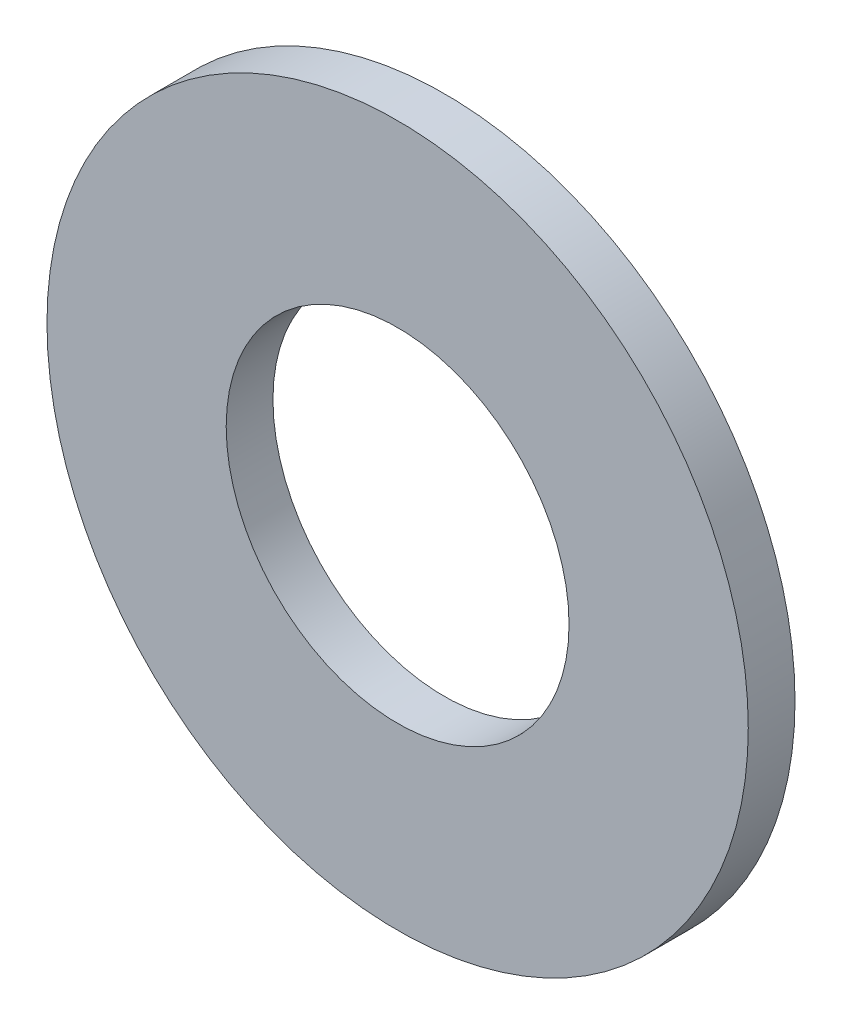
ISO-10303-21;
HEADER;
FILE_DESCRIPTION(('STEP AP214'),'2;1');
FILE_NAME('part.step','',(''),(''),'','','');
FILE_SCHEMA(('AUTOMOTIVE_DESIGN { 1 0 10303 214 1 1 1 1 }'));
ENDSEC;
DATA;
#1=APPLICATION_CONTEXT('core data for automotive mechanical design processes');
#2=APPLICATION_PROTOCOL_DEFINITION('international standard','automotive_design',2000,#1);
#3=PRODUCT_CONTEXT('',#1,'mechanical');
#4=PRODUCT('Part','Part','',(#3));
#5=PRODUCT_RELATED_PRODUCT_CATEGORY('part','',(#4));
#6=PRODUCT_DEFINITION_FORMATION('','',#4);
#7=PRODUCT_DEFINITION_CONTEXT('part definition',#1,'design');
#8=PRODUCT_DEFINITION('design','',#6,#7);
#9=PRODUCT_DEFINITION_SHAPE('','',#8);
#10=(LENGTH_UNIT() NAMED_UNIT(*) SI_UNIT(.MILLI.,.METRE.));
#11=(NAMED_UNIT(*) PLANE_ANGLE_UNIT() SI_UNIT($,.RADIAN.));
#12=(NAMED_UNIT(*) SI_UNIT($,.STERADIAN.) SOLID_ANGLE_UNIT());
#13=UNCERTAINTY_MEASURE_WITH_UNIT(LENGTH_MEASURE(1.E-05),#10,'distance_accuracy_value','');
#14=(GEOMETRIC_REPRESENTATION_CONTEXT(3) GLOBAL_UNCERTAINTY_ASSIGNED_CONTEXT((#13)) GLOBAL_UNIT_ASSIGNED_CONTEXT((#10,
#11,#12)) REPRESENTATION_CONTEXT('',''));
#15=CARTESIAN_POINT('',(0.,0.,0.));
#16=DIRECTION('',(0.,0.,1.));
#17=DIRECTION('',(1.,0.,0.));
#18=AXIS2_PLACEMENT_3D('',#15,#16,#17);
#19=CARTESIAN_POINT('',(0.,0.,-3.));
#20=DIRECTION('',(0.,0.,1.));
#21=DIRECTION('',(1.,0.,0.));
#22=AXIS2_PLACEMENT_3D('',#19,#20,#21);
#23=CYLINDRICAL_SURFACE('',#22,22.5);
#24=CARTESIAN_POINT('',(0.,0.,-3.));
#25=DIRECTION('',(0.,0.,1.));
#26=DIRECTION('',(1.,0.,0.));
#27=AXIS2_PLACEMENT_3D('',#24,#25,#26);
#28=CIRCLE('',#27,22.5);
#29=CARTESIAN_POINT('',(22.5,0.,-3.));
#30=VERTEX_POINT('',#29);
#31=EDGE_CURVE('E10',#30,#30,#28,.T.);
#32=ORIENTED_EDGE('',*,*,#31,.T.);
#33=EDGE_LOOP('',(#32));
#34=FACE_BOUND('',#33,.T.);
#35=CARTESIAN_POINT('',(0.,0.,0.));
#36=DIRECTION('',(0.,0.,1.));
#37=DIRECTION('',(1.,0.,0.));
#38=AXIS2_PLACEMENT_3D('',#35,#36,#37);
#39=CIRCLE('',#38,22.5);
#40=CARTESIAN_POINT('',(22.5,0.,0.));
#41=VERTEX_POINT('',#40);
#42=EDGE_CURVE('E40',#41,#41,#39,.T.);
#43=ORIENTED_EDGE('',*,*,#42,.F.);
#44=EDGE_LOOP('',(#43));
#45=FACE_BOUND('',#44,.T.);
#46=ADVANCED_FACE('F37',(#34,#45),#23,.T.);
#47=CARTESIAN_POINT('',(0.,0.,-3.));
#48=DIRECTION('',(0.,0.,1.));
#49=DIRECTION('',(1.,0.,0.));
#50=AXIS2_PLACEMENT_3D('',#47,#48,#49);
#51=PLANE('',#50);
#52=CARTESIAN_POINT('',(0.,0.,-3.));
#53=DIRECTION('',(0.,0.,1.));
#54=DIRECTION('',(1.,0.,0.));
#55=AXIS2_PLACEMENT_3D('',#52,#53,#54);
#56=CIRCLE('',#55,11.);
#57=CARTESIAN_POINT('',(11.,0.,-3.));
#58=VERTEX_POINT('',#57);
#59=EDGE_CURVE('E47',#58,#58,#56,.T.);
#60=ORIENTED_EDGE('',*,*,#59,.T.);
#61=EDGE_LOOP('',(#60));
#62=FACE_BOUND('',#61,.T.);
#63=ORIENTED_EDGE('',*,*,#31,.F.);
#64=EDGE_LOOP('',(#63));
#65=FACE_BOUND('',#64,.T.);
#66=ADVANCED_FACE('F55',(#62,#65),#51,.F.);
#67=CARTESIAN_POINT('',(0.,0.,0.));
#68=DIRECTION('',(0.,0.,1.));
#69=DIRECTION('',(1.,0.,0.));
#70=AXIS2_PLACEMENT_3D('',#67,#68,#69);
#71=PLANE('',#70);
#72=CARTESIAN_POINT('',(0.,0.,0.));
#73=DIRECTION('',(0.,0.,1.));
#74=DIRECTION('',(1.,0.,0.));
#75=AXIS2_PLACEMENT_3D('',#72,#73,#74);
#76=CIRCLE('',#75,11.);
#77=CARTESIAN_POINT('',(11.,0.,0.));
#78=VERTEX_POINT('',#77);
#79=EDGE_CURVE('E49',#78,#78,#76,.T.);
#80=ORIENTED_EDGE('',*,*,#79,.F.);
#81=EDGE_LOOP('',(#80));
#82=FACE_BOUND('',#81,.T.);
#83=ORIENTED_EDGE('',*,*,#42,.T.);
#84=EDGE_LOOP('',(#83));
#85=FACE_BOUND('',#84,.T.);
#86=ADVANCED_FACE('F61',(#82,#85),#71,.T.);
#87=CARTESIAN_POINT('',(0.,0.,-3.));
#88=DIRECTION('',(0.,0.,1.));
#89=DIRECTION('',(1.,0.,0.));
#90=AXIS2_PLACEMENT_3D('',#87,#88,#89);
#91=CYLINDRICAL_SURFACE('',#90,11.);
#92=ORIENTED_EDGE('',*,*,#59,.F.);
#93=EDGE_LOOP('',(#92));
#94=FACE_BOUND('',#93,.T.);
#95=ORIENTED_EDGE('',*,*,#79,.T.);
#96=EDGE_LOOP('',(#95));
#97=FACE_BOUND('',#96,.T.);
#98=ADVANCED_FACE('F58',(#94,#97),#91,.F.);
#99=CLOSED_SHELL('',(#46,#66,#86,#98));
#100=MANIFOLD_SOLID_BREP('B2',#99);
#101=ADVANCED_BREP_SHAPE_REPRESENTATION('',(#18,#100),#14);
#102=SHAPE_DEFINITION_REPRESENTATION(#9,#101);
ENDSEC;
END-ISO-10303-21;
